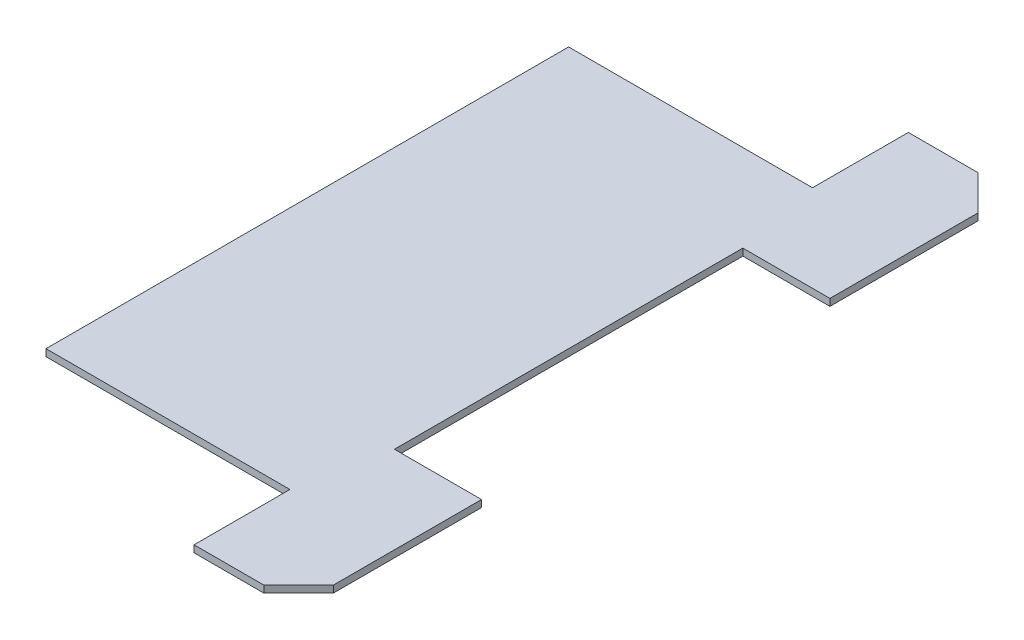
ISO-10303-21;
HEADER;
FILE_DESCRIPTION(('STEP AP214'),'2;1');
FILE_NAME('part.step','',(''),(''),'','','');
FILE_SCHEMA(('AUTOMOTIVE_DESIGN { 1 0 10303 214 1 1 1 1 }'));
ENDSEC;
DATA;
#1=APPLICATION_CONTEXT('core data for automotive mechanical design processes');
#2=APPLICATION_PROTOCOL_DEFINITION('international standard','automotive_design',2000,#1);
#3=PRODUCT_CONTEXT('',#1,'mechanical');
#4=PRODUCT('Part','Part','',(#3));
#5=PRODUCT_RELATED_PRODUCT_CATEGORY('part','',(#4));
#6=PRODUCT_DEFINITION_FORMATION('','',#4);
#7=PRODUCT_DEFINITION_CONTEXT('part definition',#1,'design');
#8=PRODUCT_DEFINITION('design','',#6,#7);
#9=PRODUCT_DEFINITION_SHAPE('','',#8);
#10=(LENGTH_UNIT() NAMED_UNIT(*) SI_UNIT(.MILLI.,.METRE.));
#11=(NAMED_UNIT(*) PLANE_ANGLE_UNIT() SI_UNIT($,.RADIAN.));
#12=(NAMED_UNIT(*) SI_UNIT($,.STERADIAN.) SOLID_ANGLE_UNIT());
#13=UNCERTAINTY_MEASURE_WITH_UNIT(LENGTH_MEASURE(1.E-05),#10,'distance_accuracy_value','');
#14=(GEOMETRIC_REPRESENTATION_CONTEXT(3) GLOBAL_UNCERTAINTY_ASSIGNED_CONTEXT((#13)) GLOBAL_UNIT_ASSIGNED_CONTEXT((#10,
#11,#12)) REPRESENTATION_CONTEXT('',''));
#15=CARTESIAN_POINT('',(0.,0.,0.));
#16=DIRECTION('',(0.,0.,1.));
#17=DIRECTION('',(1.,0.,0.));
#18=AXIS2_PLACEMENT_3D('',#15,#16,#17);
#19=CARTESIAN_POINT('',(2.,0.2,-10.25));
#20=DIRECTION('',(0.,0.,1.));
#21=DIRECTION('',(1.,0.,0.));
#22=AXIS2_PLACEMENT_3D('',#19,#20,#21);
#23=PLANE('',#22);
#24=DIRECTION('',(-1.,0.,0.));
#25=VECTOR('',#24,1.);
#26=CARTESIAN_POINT('',(2.,0.,-10.25));
#27=LINE('',#26,#25);
#28=CARTESIAN_POINT('',(4.00000000000001,0.,-10.25));
#29=VERTEX_POINT('',#28);
#30=CARTESIAN_POINT('',(2.,0.,-10.25));
#31=VERTEX_POINT('',#30);
#32=EDGE_CURVE('E165',#29,#31,#27,.T.);
#33=ORIENTED_EDGE('',*,*,#32,.T.);
#34=DIRECTION('',(0.,-1.,0.));
#35=VECTOR('',#34,1.);
#36=CARTESIAN_POINT('',(2.,0.2,-10.25));
#37=LINE('',#36,#35);
#38=CARTESIAN_POINT('',(2.,0.2,-10.25));
#39=VERTEX_POINT('',#38);
#40=EDGE_CURVE('E11',#39,#31,#37,.T.);
#41=ORIENTED_EDGE('',*,*,#40,.F.);
#42=DIRECTION('',(-1.,0.,0.));
#43=VECTOR('',#42,1.);
#44=CARTESIAN_POINT('',(2.,0.2,-10.25));
#45=LINE('',#44,#43);
#46=CARTESIAN_POINT('',(4.00000000000001,0.2,-10.25));
#47=VERTEX_POINT('',#46);
#48=EDGE_CURVE('E191',#47,#39,#45,.T.);
#49=ORIENTED_EDGE('',*,*,#48,.F.);
#50=DIRECTION('',(0.,-1.,0.));
#51=VECTOR('',#50,1.);
#52=CARTESIAN_POINT('',(4.00000000000001,0.2,-10.25));
#53=LINE('',#52,#51);
#54=EDGE_CURVE('E161',#47,#29,#53,.T.);
#55=ORIENTED_EDGE('',*,*,#54,.T.);
#56=EDGE_LOOP('',(#33,#41,#49,#55));
#57=FACE_BOUND('',#56,.T.);
#58=ADVANCED_FACE('F33',(#57),#23,.F.);
#59=CARTESIAN_POINT('',(2.,0.2,-7.5));
#60=DIRECTION('',(1.,0.,0.));
#61=DIRECTION('',(0.,0.,-1.));
#62=AXIS2_PLACEMENT_3D('',#59,#60,#61);
#63=PLANE('',#62);
#64=DIRECTION('',(0.,0.,1.));
#65=VECTOR('',#64,1.);
#66=CARTESIAN_POINT('',(2.,0.,-7.5));
#67=LINE('',#66,#65);
#68=CARTESIAN_POINT('',(2.,0.,-7.5));
#69=VERTEX_POINT('',#68);
#70=EDGE_CURVE('E168',#31,#69,#67,.T.);
#71=ORIENTED_EDGE('',*,*,#70,.T.);
#72=DIRECTION('',(0.,-1.,0.));
#73=VECTOR('',#72,1.);
#74=CARTESIAN_POINT('',(2.,0.2,-7.5));
#75=LINE('',#74,#73);
#76=CARTESIAN_POINT('',(2.,0.2,-7.5));
#77=VERTEX_POINT('',#76);
#78=EDGE_CURVE('E41',#77,#69,#75,.T.);
#79=ORIENTED_EDGE('',*,*,#78,.F.);
#80=DIRECTION('',(0.,0.,1.));
#81=VECTOR('',#80,1.);
#82=CARTESIAN_POINT('',(2.,0.2,-7.5));
#83=LINE('',#82,#81);
#84=EDGE_CURVE('E110',#39,#77,#83,.T.);
#85=ORIENTED_EDGE('',*,*,#84,.F.);
#86=ORIENTED_EDGE('',*,*,#40,.T.);
#87=EDGE_LOOP('',(#71,#79,#85,#86));
#88=FACE_BOUND('',#87,.T.);
#89=ADVANCED_FACE('F279',(#88),#63,.F.);
#90=CARTESIAN_POINT('',(-5.,0.2,-7.5));
#91=DIRECTION('',(0.,0.,1.));
#92=DIRECTION('',(1.,0.,0.));
#93=AXIS2_PLACEMENT_3D('',#90,#91,#92);
#94=PLANE('',#93);
#95=DIRECTION('',(-1.,0.,0.));
#96=VECTOR('',#95,1.);
#97=CARTESIAN_POINT('',(-5.,0.,-7.5));
#98=LINE('',#97,#96);
#99=CARTESIAN_POINT('',(-5.,0.,-7.5));
#100=VERTEX_POINT('',#99);
#101=EDGE_CURVE('E170',#69,#100,#98,.T.);
#102=ORIENTED_EDGE('',*,*,#101,.T.);
#103=DIRECTION('',(0.,-1.,0.));
#104=VECTOR('',#103,1.);
#105=CARTESIAN_POINT('',(-5.,0.2,-7.5));
#106=LINE('',#105,#104);
#107=CARTESIAN_POINT('',(-5.,0.2,-7.5));
#108=VERTEX_POINT('',#107);
#109=EDGE_CURVE('E216',#108,#100,#106,.T.);
#110=ORIENTED_EDGE('',*,*,#109,.F.);
#111=DIRECTION('',(-1.,0.,0.));
#112=VECTOR('',#111,1.);
#113=CARTESIAN_POINT('',(-5.,0.2,-7.5));
#114=LINE('',#113,#112);
#115=EDGE_CURVE('E224',#77,#108,#114,.T.);
#116=ORIENTED_EDGE('',*,*,#115,.F.);
#117=ORIENTED_EDGE('',*,*,#78,.T.);
#118=EDGE_LOOP('',(#102,#110,#116,#117));
#119=FACE_BOUND('',#118,.T.);
#120=ADVANCED_FACE('F222',(#119),#94,.F.);
#121=CARTESIAN_POINT('',(-5.,0.2,-7.5));
#122=DIRECTION('',(1.,0.,0.));
#123=DIRECTION('',(0.,0.,-1.));
#124=AXIS2_PLACEMENT_3D('',#121,#122,#123);
#125=PLANE('',#124);
#126=DIRECTION('',(0.,0.,1.));
#127=VECTOR('',#126,1.);
#128=CARTESIAN_POINT('',(-5.,0.,-7.5));
#129=LINE('',#128,#127);
#130=CARTESIAN_POINT('',(-5.,0.,7.5));
#131=VERTEX_POINT('',#130);
#132=EDGE_CURVE('E172',#100,#131,#129,.T.);
#133=ORIENTED_EDGE('',*,*,#132,.T.);
#134=DIRECTION('',(0.,-1.,0.));
#135=VECTOR('',#134,1.);
#136=CARTESIAN_POINT('',(-5.,0.2,7.5));
#137=LINE('',#136,#135);
#138=CARTESIAN_POINT('',(-5.,0.2,7.5));
#139=VERTEX_POINT('',#138);
#140=EDGE_CURVE('E213',#139,#131,#137,.T.);
#141=ORIENTED_EDGE('',*,*,#140,.F.);
#142=DIRECTION('',(0.,0.,1.));
#143=VECTOR('',#142,1.);
#144=CARTESIAN_POINT('',(-5.,0.2,-7.5));
#145=LINE('',#144,#143);
#146=EDGE_CURVE('E242',#108,#139,#145,.T.);
#147=ORIENTED_EDGE('',*,*,#146,.F.);
#148=ORIENTED_EDGE('',*,*,#109,.T.);
#149=EDGE_LOOP('',(#133,#141,#147,#148));
#150=FACE_BOUND('',#149,.T.);
#151=ADVANCED_FACE('F233',(#150),#125,.F.);
#152=CARTESIAN_POINT('',(-5.,0.2,7.5));
#153=DIRECTION('',(0.,0.,-1.));
#154=DIRECTION('',(-1.,0.,0.));
#155=AXIS2_PLACEMENT_3D('',#152,#153,#154);
#156=PLANE('',#155);
#157=DIRECTION('',(1.,0.,0.));
#158=VECTOR('',#157,1.);
#159=CARTESIAN_POINT('',(-5.,0.,7.5));
#160=LINE('',#159,#158);
#161=CARTESIAN_POINT('',(2.,0.,7.5));
#162=VERTEX_POINT('',#161);
#163=EDGE_CURVE('E174',#131,#162,#160,.T.);
#164=ORIENTED_EDGE('',*,*,#163,.T.);
#165=DIRECTION('',(0.,-1.,0.));
#166=VECTOR('',#165,1.);
#167=CARTESIAN_POINT('',(2.,0.2,7.5));
#168=LINE('',#167,#166);
#169=CARTESIAN_POINT('',(2.,0.2,7.5));
#170=VERTEX_POINT('',#169);
#171=EDGE_CURVE('E210',#170,#162,#168,.T.);
#172=ORIENTED_EDGE('',*,*,#171,.F.);
#173=DIRECTION('',(1.,0.,0.));
#174=VECTOR('',#173,1.);
#175=CARTESIAN_POINT('',(-5.,0.2,7.5));
#176=LINE('',#175,#174);
#177=EDGE_CURVE('E239',#139,#170,#176,.T.);
#178=ORIENTED_EDGE('',*,*,#177,.F.);
#179=ORIENTED_EDGE('',*,*,#140,.T.);
#180=EDGE_LOOP('',(#164,#172,#178,#179));
#181=FACE_BOUND('',#180,.T.);
#182=ADVANCED_FACE('F237',(#181),#156,.F.);
#183=CARTESIAN_POINT('',(2.,0.2,7.5));
#184=DIRECTION('',(1.,0.,0.));
#185=DIRECTION('',(0.,0.,-1.));
#186=AXIS2_PLACEMENT_3D('',#183,#184,#185);
#187=PLANE('',#186);
#188=DIRECTION('',(0.,0.,1.));
#189=VECTOR('',#188,1.);
#190=CARTESIAN_POINT('',(2.,0.,7.5));
#191=LINE('',#190,#189);
#192=CARTESIAN_POINT('',(2.,0.,10.25));
#193=VERTEX_POINT('',#192);
#194=EDGE_CURVE('E176',#162,#193,#191,.T.);
#195=ORIENTED_EDGE('',*,*,#194,.T.);
#196=DIRECTION('',(0.,-1.,0.));
#197=VECTOR('',#196,1.);
#198=CARTESIAN_POINT('',(2.,0.2,10.25));
#199=LINE('',#198,#197);
#200=CARTESIAN_POINT('',(2.,0.2,10.25));
#201=VERTEX_POINT('',#200);
#202=EDGE_CURVE('E207',#201,#193,#199,.T.);
#203=ORIENTED_EDGE('',*,*,#202,.F.);
#204=DIRECTION('',(0.,0.,1.));
#205=VECTOR('',#204,1.);
#206=CARTESIAN_POINT('',(2.,0.2,7.5));
#207=LINE('',#206,#205);
#208=EDGE_CURVE('E241',#170,#201,#207,.T.);
#209=ORIENTED_EDGE('',*,*,#208,.F.);
#210=ORIENTED_EDGE('',*,*,#171,.T.);
#211=EDGE_LOOP('',(#195,#203,#209,#210));
#212=FACE_BOUND('',#211,.T.);
#213=ADVANCED_FACE('F292',(#212),#187,.F.);
#214=CARTESIAN_POINT('',(2.,0.2,10.25));
#215=DIRECTION('',(0.,0.,-1.));
#216=DIRECTION('',(-1.,0.,0.));
#217=AXIS2_PLACEMENT_3D('',#214,#215,#216);
#218=PLANE('',#217);
#219=DIRECTION('',(1.,0.,0.));
#220=VECTOR('',#219,1.);
#221=CARTESIAN_POINT('',(2.,0.,10.25));
#222=LINE('',#221,#220);
#223=CARTESIAN_POINT('',(4.00000000000001,0.,10.25));
#224=VERTEX_POINT('',#223);
#225=EDGE_CURVE('E178',#193,#224,#222,.T.);
#226=ORIENTED_EDGE('',*,*,#225,.T.);
#227=DIRECTION('',(0.,-1.,0.));
#228=VECTOR('',#227,1.);
#229=CARTESIAN_POINT('',(4.00000000000001,0.2,10.25));
#230=LINE('',#229,#228);
#231=CARTESIAN_POINT('',(4.00000000000001,0.2,10.25));
#232=VERTEX_POINT('',#231);
#233=EDGE_CURVE('E204',#232,#224,#230,.T.);
#234=ORIENTED_EDGE('',*,*,#233,.F.);
#235=DIRECTION('',(1.,0.,0.));
#236=VECTOR('',#235,1.);
#237=CARTESIAN_POINT('',(2.,0.2,10.25));
#238=LINE('',#237,#236);
#239=EDGE_CURVE('E244',#201,#232,#238,.T.);
#240=ORIENTED_EDGE('',*,*,#239,.F.);
#241=ORIENTED_EDGE('',*,*,#202,.T.);
#242=EDGE_LOOP('',(#226,#234,#240,#241));
#243=FACE_BOUND('',#242,.T.);
#244=ADVANCED_FACE('F295',(#243),#218,.F.);
#245=CARTESIAN_POINT('',(4.00000000000001,0.2,10.25));
#246=DIRECTION('',(-0.707106781186548,0.,-0.707106781186547));
#247=DIRECTION('',(-0.707106781186547,0.,0.707106781186548));
#248=AXIS2_PLACEMENT_3D('',#245,#246,#247);
#249=PLANE('',#248);
#250=DIRECTION('',(0.707106781186547,0.,-0.707106781186548));
#251=VECTOR('',#250,1.);
#252=CARTESIAN_POINT('',(4.00000000000001,0.,10.25));
#253=LINE('',#252,#251);
#254=CARTESIAN_POINT('',(5.,0.,9.25000000000001));
#255=VERTEX_POINT('',#254);
#256=EDGE_CURVE('E180',#224,#255,#253,.T.);
#257=ORIENTED_EDGE('',*,*,#256,.T.);
#258=DIRECTION('',(0.,-1.,0.));
#259=VECTOR('',#258,1.);
#260=CARTESIAN_POINT('',(5.,0.2,9.25000000000001));
#261=LINE('',#260,#259);
#262=CARTESIAN_POINT('',(5.,0.2,9.25000000000001));
#263=VERTEX_POINT('',#262);
#264=EDGE_CURVE('E201',#263,#255,#261,.T.);
#265=ORIENTED_EDGE('',*,*,#264,.F.);
#266=DIRECTION('',(0.707106781186547,0.,-0.707106781186548));
#267=VECTOR('',#266,1.);
#268=CARTESIAN_POINT('',(4.00000000000001,0.2,10.25));
#269=LINE('',#268,#267);
#270=EDGE_CURVE('E250',#232,#263,#269,.T.);
#271=ORIENTED_EDGE('',*,*,#270,.F.);
#272=ORIENTED_EDGE('',*,*,#233,.T.);
#273=EDGE_LOOP('',(#257,#265,#271,#272));
#274=FACE_BOUND('',#273,.T.);
#275=ADVANCED_FACE('F299',(#274),#249,.F.);
#276=CARTESIAN_POINT('',(5.,0.2,9.25000000000001));
#277=DIRECTION('',(-1.,0.,0.));
#278=DIRECTION('',(0.,0.,1.));
#279=AXIS2_PLACEMENT_3D('',#276,#277,#278);
#280=PLANE('',#279);
#281=DIRECTION('',(0.,0.,-1.));
#282=VECTOR('',#281,1.);
#283=CARTESIAN_POINT('',(5.,0.,9.25000000000001));
#284=LINE('',#283,#282);
#285=CARTESIAN_POINT('',(5.,0.,5.));
#286=VERTEX_POINT('',#285);
#287=EDGE_CURVE('E182',#255,#286,#284,.T.);
#288=ORIENTED_EDGE('',*,*,#287,.T.);
#289=DIRECTION('',(0.,-1.,0.));
#290=VECTOR('',#289,1.);
#291=CARTESIAN_POINT('',(5.,0.2,5.));
#292=LINE('',#291,#290);
#293=CARTESIAN_POINT('',(5.,0.2,5.));
#294=VERTEX_POINT('',#293);
#295=EDGE_CURVE('E198',#294,#286,#292,.T.);
#296=ORIENTED_EDGE('',*,*,#295,.F.);
#297=DIRECTION('',(0.,0.,-1.));
#298=VECTOR('',#297,1.);
#299=CARTESIAN_POINT('',(5.,0.2,9.25000000000001));
#300=LINE('',#299,#298);
#301=EDGE_CURVE('E252',#263,#294,#300,.T.);
#302=ORIENTED_EDGE('',*,*,#301,.F.);
#303=ORIENTED_EDGE('',*,*,#264,.T.);
#304=EDGE_LOOP('',(#288,#296,#302,#303));
#305=FACE_BOUND('',#304,.T.);
#306=ADVANCED_FACE('F303',(#305),#280,.F.);
#307=CARTESIAN_POINT('',(5.,0.2,5.));
#308=DIRECTION('',(0.,0.,1.));
#309=DIRECTION('',(1.,0.,0.));
#310=AXIS2_PLACEMENT_3D('',#307,#308,#309);
#311=PLANE('',#310);
#312=DIRECTION('',(-1.,0.,0.));
#313=VECTOR('',#312,1.);
#314=CARTESIAN_POINT('',(5.,0.,5.));
#315=LINE('',#314,#313);
#316=CARTESIAN_POINT('',(2.5,0.,5.));
#317=VERTEX_POINT('',#316);
#318=EDGE_CURVE('E184',#286,#317,#315,.T.);
#319=ORIENTED_EDGE('',*,*,#318,.T.);
#320=DIRECTION('',(0.,-1.,0.));
#321=VECTOR('',#320,1.);
#322=CARTESIAN_POINT('',(2.5,0.2,5.));
#323=LINE('',#322,#321);
#324=CARTESIAN_POINT('',(2.5,0.2,5.));
#325=VERTEX_POINT('',#324);
#326=EDGE_CURVE('E195',#325,#317,#323,.T.);
#327=ORIENTED_EDGE('',*,*,#326,.F.);
#328=DIRECTION('',(-1.,0.,0.));
#329=VECTOR('',#328,1.);
#330=CARTESIAN_POINT('',(5.,0.2,5.));
#331=LINE('',#330,#329);
#332=EDGE_CURVE('E254',#294,#325,#331,.T.);
#333=ORIENTED_EDGE('',*,*,#332,.F.);
#334=ORIENTED_EDGE('',*,*,#295,.T.);
#335=EDGE_LOOP('',(#319,#327,#333,#334));
#336=FACE_BOUND('',#335,.T.);
#337=ADVANCED_FACE('F260',(#336),#311,.F.);
#338=CARTESIAN_POINT('',(2.5,0.2,5.));
#339=DIRECTION('',(-1.,0.,0.));
#340=DIRECTION('',(0.,0.,1.));
#341=AXIS2_PLACEMENT_3D('',#338,#339,#340);
#342=PLANE('',#341);
#343=DIRECTION('',(0.,0.,-1.));
#344=VECTOR('',#343,1.);
#345=CARTESIAN_POINT('',(2.5,0.,5.));
#346=LINE('',#345,#344);
#347=CARTESIAN_POINT('',(2.5,0.,-5.));
#348=VERTEX_POINT('',#347);
#349=EDGE_CURVE('E186',#317,#348,#346,.T.);
#350=ORIENTED_EDGE('',*,*,#349,.T.);
#351=DIRECTION('',(0.,-1.,0.));
#352=VECTOR('',#351,1.);
#353=CARTESIAN_POINT('',(2.5,0.2,-5.));
#354=LINE('',#353,#352);
#355=CARTESIAN_POINT('',(2.5,0.2,-5.));
#356=VERTEX_POINT('',#355);
#357=EDGE_CURVE('E156',#356,#348,#354,.T.);
#358=ORIENTED_EDGE('',*,*,#357,.F.);
#359=DIRECTION('',(0.,0.,-1.));
#360=VECTOR('',#359,1.);
#361=CARTESIAN_POINT('',(2.5,0.2,5.));
#362=LINE('',#361,#360);
#363=EDGE_CURVE('E147',#325,#356,#362,.T.);
#364=ORIENTED_EDGE('',*,*,#363,.F.);
#365=ORIENTED_EDGE('',*,*,#326,.T.);
#366=EDGE_LOOP('',(#350,#358,#364,#365));
#367=FACE_BOUND('',#366,.T.);
#368=ADVANCED_FACE('F264',(#367),#342,.F.);
#369=CARTESIAN_POINT('',(2.5,0.2,-5.));
#370=DIRECTION('',(0.,0.,-1.));
#371=DIRECTION('',(-1.,0.,0.));
#372=AXIS2_PLACEMENT_3D('',#369,#370,#371);
#373=PLANE('',#372);
#374=DIRECTION('',(1.,0.,0.));
#375=VECTOR('',#374,1.);
#376=CARTESIAN_POINT('',(2.5,0.,-5.));
#377=LINE('',#376,#375);
#378=CARTESIAN_POINT('',(5.,0.,-5.));
#379=VERTEX_POINT('',#378);
#380=EDGE_CURVE('E155',#348,#379,#377,.T.);
#381=ORIENTED_EDGE('',*,*,#380,.T.);
#382=DIRECTION('',(0.,-1.,0.));
#383=VECTOR('',#382,1.);
#384=CARTESIAN_POINT('',(5.,0.2,-5.));
#385=LINE('',#384,#383);
#386=CARTESIAN_POINT('',(5.,0.2,-5.));
#387=VERTEX_POINT('',#386);
#388=EDGE_CURVE('E152',#387,#379,#385,.T.);
#389=ORIENTED_EDGE('',*,*,#388,.F.);
#390=DIRECTION('',(1.,0.,0.));
#391=VECTOR('',#390,1.);
#392=CARTESIAN_POINT('',(2.5,0.2,-5.));
#393=LINE('',#392,#391);
#394=EDGE_CURVE('E141',#356,#387,#393,.T.);
#395=ORIENTED_EDGE('',*,*,#394,.F.);
#396=ORIENTED_EDGE('',*,*,#357,.T.);
#397=EDGE_LOOP('',(#381,#389,#395,#396));
#398=FACE_BOUND('',#397,.T.);
#399=ADVANCED_FACE('F153',(#398),#373,.F.);
#400=CARTESIAN_POINT('',(5.,0.2,-5.));
#401=DIRECTION('',(-1.,0.,0.));
#402=DIRECTION('',(0.,0.,1.));
#403=AXIS2_PLACEMENT_3D('',#400,#401,#402);
#404=PLANE('',#403);
#405=DIRECTION('',(0.,0.,-1.));
#406=VECTOR('',#405,1.);
#407=CARTESIAN_POINT('',(5.,0.,-5.));
#408=LINE('',#407,#406);
#409=CARTESIAN_POINT('',(5.,0.,-9.25000000000001));
#410=VERTEX_POINT('',#409);
#411=EDGE_CURVE('E96',#379,#410,#408,.T.);
#412=ORIENTED_EDGE('',*,*,#411,.T.);
#413=DIRECTION('',(0.,-1.,0.));
#414=VECTOR('',#413,1.);
#415=CARTESIAN_POINT('',(5.,0.2,-9.25000000000001));
#416=LINE('',#415,#414);
#417=CARTESIAN_POINT('',(5.,0.2,-9.25000000000001));
#418=VERTEX_POINT('',#417);
#419=EDGE_CURVE('E157',#418,#410,#416,.T.);
#420=ORIENTED_EDGE('',*,*,#419,.F.);
#421=DIRECTION('',(0.,0.,-1.));
#422=VECTOR('',#421,1.);
#423=CARTESIAN_POINT('',(5.,0.2,-5.));
#424=LINE('',#423,#422);
#425=EDGE_CURVE('E145',#387,#418,#424,.T.);
#426=ORIENTED_EDGE('',*,*,#425,.F.);
#427=ORIENTED_EDGE('',*,*,#388,.T.);
#428=EDGE_LOOP('',(#412,#420,#426,#427));
#429=FACE_BOUND('',#428,.T.);
#430=ADVANCED_FACE('F159',(#429),#404,.F.);
#431=CARTESIAN_POINT('',(4.00000000000001,0.2,-10.25));
#432=DIRECTION('',(-0.707106781186547,0.,0.707106781186548));
#433=DIRECTION('',(0.707106781186548,0.,0.707106781186547));
#434=AXIS2_PLACEMENT_3D('',#431,#432,#433);
#435=PLANE('',#434);
#436=DIRECTION('',(-0.707106781186548,0.,-0.707106781186547));
#437=VECTOR('',#436,1.);
#438=CARTESIAN_POINT('',(4.00000000000001,0.,-10.25));
#439=LINE('',#438,#437);
#440=EDGE_CURVE('E102',#410,#29,#439,.T.);
#441=ORIENTED_EDGE('',*,*,#440,.T.);
#442=ORIENTED_EDGE('',*,*,#54,.F.);
#443=DIRECTION('',(-0.707106781186548,0.,-0.707106781186547));
#444=VECTOR('',#443,1.);
#445=CARTESIAN_POINT('',(4.00000000000001,0.2,-10.25));
#446=LINE('',#445,#444);
#447=EDGE_CURVE('E49',#418,#47,#446,.T.);
#448=ORIENTED_EDGE('',*,*,#447,.F.);
#449=ORIENTED_EDGE('',*,*,#419,.T.);
#450=EDGE_LOOP('',(#441,#442,#448,#449));
#451=FACE_BOUND('',#450,.T.);
#452=ADVANCED_FACE('F268',(#451),#435,.F.);
#453=CARTESIAN_POINT('',(5.,0.2,-10.25));
#454=DIRECTION('',(0.,1.,0.));
#455=DIRECTION('',(0.,0.,1.));
#456=AXIS2_PLACEMENT_3D('',#453,#454,#455);
#457=PLANE('',#456);
#458=ORIENTED_EDGE('',*,*,#48,.T.);
#459=ORIENTED_EDGE('',*,*,#84,.T.);
#460=ORIENTED_EDGE('',*,*,#115,.T.);
#461=ORIENTED_EDGE('',*,*,#146,.T.);
#462=ORIENTED_EDGE('',*,*,#177,.T.);
#463=ORIENTED_EDGE('',*,*,#208,.T.);
#464=ORIENTED_EDGE('',*,*,#239,.T.);
#465=ORIENTED_EDGE('',*,*,#270,.T.);
#466=ORIENTED_EDGE('',*,*,#301,.T.);
#467=ORIENTED_EDGE('',*,*,#332,.T.);
#468=ORIENTED_EDGE('',*,*,#363,.T.);
#469=ORIENTED_EDGE('',*,*,#394,.T.);
#470=ORIENTED_EDGE('',*,*,#425,.T.);
#471=ORIENTED_EDGE('',*,*,#447,.T.);
#472=EDGE_LOOP('',(#458,#459,#460,#461,#462,#463,#464,#465,#466,#467,#468,#469,#470,#471));
#473=FACE_BOUND('',#472,.T.);
#474=ADVANCED_FACE('F143',(#473),#457,.T.);
#475=CARTESIAN_POINT('',(5.,0.,-10.25));
#476=DIRECTION('',(0.,1.,0.));
#477=DIRECTION('',(0.,0.,1.));
#478=AXIS2_PLACEMENT_3D('',#475,#476,#477);
#479=PLANE('',#478);
#480=ORIENTED_EDGE('',*,*,#32,.F.);
#481=ORIENTED_EDGE('',*,*,#440,.F.);
#482=ORIENTED_EDGE('',*,*,#411,.F.);
#483=ORIENTED_EDGE('',*,*,#380,.F.);
#484=ORIENTED_EDGE('',*,*,#349,.F.);
#485=ORIENTED_EDGE('',*,*,#318,.F.);
#486=ORIENTED_EDGE('',*,*,#287,.F.);
#487=ORIENTED_EDGE('',*,*,#256,.F.);
#488=ORIENTED_EDGE('',*,*,#225,.F.);
#489=ORIENTED_EDGE('',*,*,#194,.F.);
#490=ORIENTED_EDGE('',*,*,#163,.F.);
#491=ORIENTED_EDGE('',*,*,#132,.F.);
#492=ORIENTED_EDGE('',*,*,#101,.F.);
#493=ORIENTED_EDGE('',*,*,#70,.F.);
#494=EDGE_LOOP('',(#480,#481,#482,#483,#484,#485,#486,#487,#488,#489,#490,#491,#492,#493));
#495=FACE_BOUND('',#494,.T.);
#496=ADVANCED_FACE('F228',(#495),#479,.F.);
#497=CLOSED_SHELL('',(#58,#89,#120,#151,#182,#213,#244,#275,#306,#337,#368,#399,#430,#452,#474,#496));
#498=MANIFOLD_SOLID_BREP('B2',#497);
#499=ADVANCED_BREP_SHAPE_REPRESENTATION('',(#18,#498),#14);
#500=SHAPE_DEFINITION_REPRESENTATION(#9,#499);
ENDSEC;
END-ISO-10303-21;
